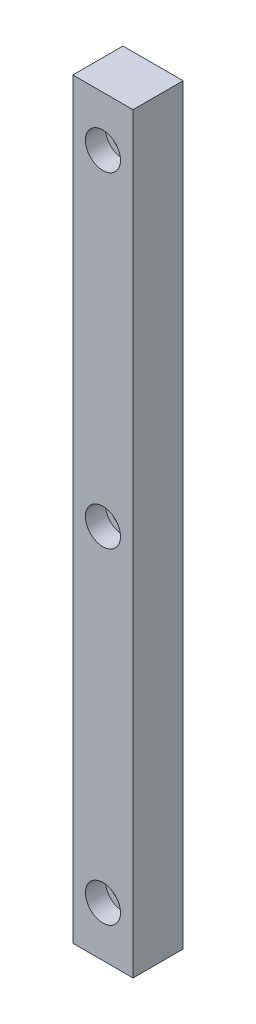
ISO-10303-21;
HEADER;
FILE_DESCRIPTION(('STEP AP214'),'2;1');
FILE_NAME('part.step','',(''),(''),'','','');
FILE_SCHEMA(('AUTOMOTIVE_DESIGN { 1 0 10303 214 1 1 1 1 }'));
ENDSEC;
DATA;
#1=APPLICATION_CONTEXT('core data for automotive mechanical design processes');
#2=APPLICATION_PROTOCOL_DEFINITION('international standard','automotive_design',2000,#1);
#3=PRODUCT_CONTEXT('',#1,'mechanical');
#4=PRODUCT('Part','Part','',(#3));
#5=PRODUCT_RELATED_PRODUCT_CATEGORY('part','',(#4));
#6=PRODUCT_DEFINITION_FORMATION('','',#4);
#7=PRODUCT_DEFINITION_CONTEXT('part definition',#1,'design');
#8=PRODUCT_DEFINITION('design','',#6,#7);
#9=PRODUCT_DEFINITION_SHAPE('','',#8);
#10=(LENGTH_UNIT() NAMED_UNIT(*) SI_UNIT(.MILLI.,.METRE.));
#11=(NAMED_UNIT(*) PLANE_ANGLE_UNIT() SI_UNIT($,.RADIAN.));
#12=(NAMED_UNIT(*) SI_UNIT($,.STERADIAN.) SOLID_ANGLE_UNIT());
#13=UNCERTAINTY_MEASURE_WITH_UNIT(LENGTH_MEASURE(1.E-05),#10,'distance_accuracy_value','');
#14=(GEOMETRIC_REPRESENTATION_CONTEXT(3) GLOBAL_UNCERTAINTY_ASSIGNED_CONTEXT((#13)) GLOBAL_UNIT_ASSIGNED_CONTEXT((#10,
#11,#12)) REPRESENTATION_CONTEXT('',''));
#15=CARTESIAN_POINT('',(0.,0.,0.));
#16=DIRECTION('',(0.,0.,1.));
#17=DIRECTION('',(1.,0.,0.));
#18=AXIS2_PLACEMENT_3D('',#15,#16,#17);
#19=CARTESIAN_POINT('',(0.,-65.,10.));
#20=DIRECTION('',(0.,0.,-1.));
#21=DIRECTION('',(-1.,0.,0.));
#22=AXIS2_PLACEMENT_3D('',#19,#20,#21);
#23=CYLINDRICAL_SURFACE('',#22,2.25);
#24=CARTESIAN_POINT('',(0.,-65.,0.));
#25=DIRECTION('',(0.,0.,1.));
#26=DIRECTION('',(1.,0.,0.));
#27=AXIS2_PLACEMENT_3D('',#24,#25,#26);
#28=CIRCLE('',#27,2.25);
#29=CARTESIAN_POINT('',(2.25,-65.,0.));
#30=VERTEX_POINT('',#29);
#31=EDGE_CURVE('E112',#30,#30,#28,.T.);
#32=ORIENTED_EDGE('',*,*,#31,.F.);
#33=EDGE_LOOP('',(#32));
#34=FACE_BOUND('',#33,.T.);
#35=CARTESIAN_POINT('',(0.,-65.,6.));
#36=DIRECTION('',(0.,0.,1.));
#37=DIRECTION('',(1.,0.,0.));
#38=AXIS2_PLACEMENT_3D('',#35,#36,#37);
#39=CIRCLE('',#38,2.25);
#40=CARTESIAN_POINT('',(2.25,-65.,6.));
#41=VERTEX_POINT('',#40);
#42=EDGE_CURVE('E38',#41,#41,#39,.T.);
#43=ORIENTED_EDGE('',*,*,#42,.T.);
#44=EDGE_LOOP('',(#43));
#45=FACE_BOUND('',#44,.T.);
#46=ADVANCED_FACE('F34',(#34,#45),#23,.F.);
#47=CARTESIAN_POINT('',(0.,0.,10.));
#48=DIRECTION('',(0.,0.,-1.));
#49=DIRECTION('',(-1.,0.,0.));
#50=AXIS2_PLACEMENT_3D('',#47,#48,#49);
#51=CYLINDRICAL_SURFACE('',#50,2.25);
#52=CARTESIAN_POINT('',(0.,0.,0.));
#53=DIRECTION('',(0.,0.,1.));
#54=DIRECTION('',(1.,0.,0.));
#55=AXIS2_PLACEMENT_3D('',#52,#53,#54);
#56=CIRCLE('',#55,2.25);
#57=CARTESIAN_POINT('',(2.25,0.,0.));
#58=VERTEX_POINT('',#57);
#59=EDGE_CURVE('E137',#58,#58,#56,.T.);
#60=ORIENTED_EDGE('',*,*,#59,.F.);
#61=EDGE_LOOP('',(#60));
#62=FACE_BOUND('',#61,.T.);
#63=CARTESIAN_POINT('',(0.,0.,6.));
#64=DIRECTION('',(0.,0.,1.));
#65=DIRECTION('',(1.,0.,0.));
#66=AXIS2_PLACEMENT_3D('',#63,#64,#65);
#67=CIRCLE('',#66,2.25);
#68=CARTESIAN_POINT('',(2.25,0.,6.));
#69=VERTEX_POINT('',#68);
#70=EDGE_CURVE('E114',#69,#69,#67,.T.);
#71=ORIENTED_EDGE('',*,*,#70,.T.);
#72=EDGE_LOOP('',(#71));
#73=FACE_BOUND('',#72,.T.);
#74=ADVANCED_FACE('F149',(#62,#73),#51,.F.);
#75=CARTESIAN_POINT('',(0.,65.,10.));
#76=DIRECTION('',(0.,0.,-1.));
#77=DIRECTION('',(-1.,0.,0.));
#78=AXIS2_PLACEMENT_3D('',#75,#76,#77);
#79=CYLINDRICAL_SURFACE('',#78,2.25);
#80=CARTESIAN_POINT('',(0.,65.,0.));
#81=DIRECTION('',(0.,0.,1.));
#82=DIRECTION('',(1.,0.,0.));
#83=AXIS2_PLACEMENT_3D('',#80,#81,#82);
#84=CIRCLE('',#83,2.25);
#85=CARTESIAN_POINT('',(2.25,65.,0.));
#86=VERTEX_POINT('',#85);
#87=EDGE_CURVE('E104',#86,#86,#84,.T.);
#88=ORIENTED_EDGE('',*,*,#87,.F.);
#89=EDGE_LOOP('',(#88));
#90=FACE_BOUND('',#89,.T.);
#91=CARTESIAN_POINT('',(0.,65.,6.));
#92=DIRECTION('',(0.,0.,1.));
#93=DIRECTION('',(1.,0.,0.));
#94=AXIS2_PLACEMENT_3D('',#91,#92,#93);
#95=CIRCLE('',#94,2.25);
#96=CARTESIAN_POINT('',(2.25,65.,6.));
#97=VERTEX_POINT('',#96);
#98=EDGE_CURVE('E110',#97,#97,#95,.T.);
#99=ORIENTED_EDGE('',*,*,#98,.T.);
#100=EDGE_LOOP('',(#99));
#101=FACE_BOUND('',#100,.T.);
#102=ADVANCED_FACE('F146',(#90,#101),#79,.F.);
#103=CARTESIAN_POINT('',(-6.,75.,10.));
#104=DIRECTION('',(0.,0.,1.));
#105=DIRECTION('',(1.,0.,0.));
#106=AXIS2_PLACEMENT_3D('',#103,#104,#105);
#107=PLANE('',#106);
#108=CARTESIAN_POINT('',(0.,-65.,10.));
#109=DIRECTION('',(0.,0.,1.));
#110=DIRECTION('',(1.,0.,0.));
#111=AXIS2_PLACEMENT_3D('',#108,#109,#110);
#112=CIRCLE('',#111,3.5);
#113=CARTESIAN_POINT('',(3.5,-65.,10.));
#114=VERTEX_POINT('',#113);
#115=EDGE_CURVE('E130',#114,#114,#112,.T.);
#116=ORIENTED_EDGE('',*,*,#115,.F.);
#117=EDGE_LOOP('',(#116));
#118=FACE_BOUND('',#117,.T.);
#119=CARTESIAN_POINT('',(0.,0.,10.));
#120=DIRECTION('',(0.,0.,1.));
#121=DIRECTION('',(1.,0.,0.));
#122=AXIS2_PLACEMENT_3D('',#119,#120,#121);
#123=CIRCLE('',#122,3.5);
#124=CARTESIAN_POINT('',(3.5,0.,10.));
#125=VERTEX_POINT('',#124);
#126=EDGE_CURVE('E123',#125,#125,#123,.T.);
#127=ORIENTED_EDGE('',*,*,#126,.F.);
#128=EDGE_LOOP('',(#127));
#129=FACE_BOUND('',#128,.T.);
#130=CARTESIAN_POINT('',(0.,65.,10.));
#131=DIRECTION('',(0.,0.,1.));
#132=DIRECTION('',(1.,0.,0.));
#133=AXIS2_PLACEMENT_3D('',#130,#131,#132);
#134=CIRCLE('',#133,3.5);
#135=CARTESIAN_POINT('',(3.5,65.,10.));
#136=VERTEX_POINT('',#135);
#137=EDGE_CURVE('E116',#136,#136,#134,.T.);
#138=ORIENTED_EDGE('',*,*,#137,.F.);
#139=EDGE_LOOP('',(#138));
#140=FACE_BOUND('',#139,.T.);
#141=DIRECTION('',(0.,-1.,0.));
#142=VECTOR('',#141,1.);
#143=CARTESIAN_POINT('',(-6.,-75.,10.));
#144=LINE('',#143,#142);
#145=CARTESIAN_POINT('',(-6.,75.,10.));
#146=VERTEX_POINT('',#145);
#147=CARTESIAN_POINT('',(-6.,-75.,10.));
#148=VERTEX_POINT('',#147);
#149=EDGE_CURVE('E88',#146,#148,#144,.T.);
#150=ORIENTED_EDGE('',*,*,#149,.T.);
#151=DIRECTION('',(1.,0.,0.));
#152=VECTOR('',#151,1.);
#153=CARTESIAN_POINT('',(6.,-75.,10.));
#154=LINE('',#153,#152);
#155=CARTESIAN_POINT('',(6.,-75.,10.));
#156=VERTEX_POINT('',#155);
#157=EDGE_CURVE('E83',#148,#156,#154,.T.);
#158=ORIENTED_EDGE('',*,*,#157,.T.);
#159=DIRECTION('',(0.,1.,0.));
#160=VECTOR('',#159,1.);
#161=CARTESIAN_POINT('',(6.,-75.,10.));
#162=LINE('',#161,#160);
#163=CARTESIAN_POINT('',(6.,75.,10.));
#164=VERTEX_POINT('',#163);
#165=EDGE_CURVE('E86',#156,#164,#162,.T.);
#166=ORIENTED_EDGE('',*,*,#165,.T.);
#167=DIRECTION('',(-1.,0.,0.));
#168=VECTOR('',#167,1.);
#169=CARTESIAN_POINT('',(6.,75.,10.));
#170=LINE('',#169,#168);
#171=EDGE_CURVE('E53',#164,#146,#170,.T.);
#172=ORIENTED_EDGE('',*,*,#171,.T.);
#173=EDGE_LOOP('',(#150,#158,#166,#172));
#174=FACE_BOUND('',#173,.T.);
#175=ADVANCED_FACE('F84',(#118,#129,#140,#174),#107,.T.);
#176=CARTESIAN_POINT('',(-6.,75.,0.));
#177=DIRECTION('',(0.,0.,1.));
#178=DIRECTION('',(1.,0.,0.));
#179=AXIS2_PLACEMENT_3D('',#176,#177,#178);
#180=PLANE('',#179);
#181=ORIENTED_EDGE('',*,*,#59,.T.);
#182=EDGE_LOOP('',(#181));
#183=FACE_BOUND('',#182,.T.);
#184=DIRECTION('',(0.,-1.,0.));
#185=VECTOR('',#184,1.);
#186=CARTESIAN_POINT('',(-6.,-75.,0.));
#187=LINE('',#186,#185);
#188=CARTESIAN_POINT('',(-6.,75.,0.));
#189=VERTEX_POINT('',#188);
#190=CARTESIAN_POINT('',(-6.,-75.,0.));
#191=VERTEX_POINT('',#190);
#192=EDGE_CURVE('E101',#189,#191,#187,.T.);
#193=ORIENTED_EDGE('',*,*,#192,.F.);
#194=DIRECTION('',(-1.,0.,0.));
#195=VECTOR('',#194,1.);
#196=CARTESIAN_POINT('',(6.,75.,0.));
#197=LINE('',#196,#195);
#198=CARTESIAN_POINT('',(6.,75.,0.));
#199=VERTEX_POINT('',#198);
#200=EDGE_CURVE('E76',#199,#189,#197,.T.);
#201=ORIENTED_EDGE('',*,*,#200,.F.);
#202=DIRECTION('',(0.,1.,0.));
#203=VECTOR('',#202,1.);
#204=CARTESIAN_POINT('',(6.,-75.,0.));
#205=LINE('',#204,#203);
#206=CARTESIAN_POINT('',(6.,-75.,0.));
#207=VERTEX_POINT('',#206);
#208=EDGE_CURVE('E70',#207,#199,#205,.T.);
#209=ORIENTED_EDGE('',*,*,#208,.F.);
#210=DIRECTION('',(1.,0.,0.));
#211=VECTOR('',#210,1.);
#212=CARTESIAN_POINT('',(6.,-75.,0.));
#213=LINE('',#212,#211);
#214=EDGE_CURVE('E92',#191,#207,#213,.T.);
#215=ORIENTED_EDGE('',*,*,#214,.F.);
#216=EDGE_LOOP('',(#193,#201,#209,#215));
#217=FACE_BOUND('',#216,.T.);
#218=ORIENTED_EDGE('',*,*,#87,.T.);
#219=EDGE_LOOP('',(#218));
#220=FACE_BOUND('',#219,.T.);
#221=ORIENTED_EDGE('',*,*,#31,.T.);
#222=EDGE_LOOP('',(#221));
#223=FACE_BOUND('',#222,.T.);
#224=ADVANCED_FACE('F143',(#183,#217,#220,#223),#180,.F.);
#225=CARTESIAN_POINT('',(-6.,-75.,10.));
#226=DIRECTION('',(1.,0.,0.));
#227=DIRECTION('',(0.,0.,-1.));
#228=AXIS2_PLACEMENT_3D('',#225,#226,#227);
#229=PLANE('',#228);
#230=ORIENTED_EDGE('',*,*,#192,.T.);
#231=DIRECTION('',(0.,0.,-1.));
#232=VECTOR('',#231,1.);
#233=CARTESIAN_POINT('',(-6.,-75.,10.));
#234=LINE('',#233,#232);
#235=EDGE_CURVE('E11',#148,#191,#234,.T.);
#236=ORIENTED_EDGE('',*,*,#235,.F.);
#237=ORIENTED_EDGE('',*,*,#149,.F.);
#238=DIRECTION('',(0.,0.,-1.));
#239=VECTOR('',#238,1.);
#240=CARTESIAN_POINT('',(-6.,75.,10.));
#241=LINE('',#240,#239);
#242=EDGE_CURVE('E97',#146,#189,#241,.T.);
#243=ORIENTED_EDGE('',*,*,#242,.T.);
#244=EDGE_LOOP('',(#230,#236,#237,#243));
#245=FACE_BOUND('',#244,.T.);
#246=ADVANCED_FACE('F36',(#245),#229,.F.);
#247=CARTESIAN_POINT('',(6.,-75.,10.));
#248=DIRECTION('',(0.,1.,0.));
#249=DIRECTION('',(0.,0.,1.));
#250=AXIS2_PLACEMENT_3D('',#247,#248,#249);
#251=PLANE('',#250);
#252=ORIENTED_EDGE('',*,*,#214,.T.);
#253=DIRECTION('',(0.,0.,-1.));
#254=VECTOR('',#253,1.);
#255=CARTESIAN_POINT('',(6.,-75.,10.));
#256=LINE('',#255,#254);
#257=EDGE_CURVE('E44',#156,#207,#256,.T.);
#258=ORIENTED_EDGE('',*,*,#257,.F.);
#259=ORIENTED_EDGE('',*,*,#157,.F.);
#260=ORIENTED_EDGE('',*,*,#235,.T.);
#261=EDGE_LOOP('',(#252,#258,#259,#260));
#262=FACE_BOUND('',#261,.T.);
#263=ADVANCED_FACE('F91',(#262),#251,.F.);
#264=CARTESIAN_POINT('',(6.,-75.,10.));
#265=DIRECTION('',(-1.,0.,0.));
#266=DIRECTION('',(0.,0.,1.));
#267=AXIS2_PLACEMENT_3D('',#264,#265,#266);
#268=PLANE('',#267);
#269=ORIENTED_EDGE('',*,*,#208,.T.);
#270=DIRECTION('',(0.,0.,-1.));
#271=VECTOR('',#270,1.);
#272=CARTESIAN_POINT('',(6.,75.,10.));
#273=LINE('',#272,#271);
#274=EDGE_CURVE('E93',#164,#199,#273,.T.);
#275=ORIENTED_EDGE('',*,*,#274,.F.);
#276=ORIENTED_EDGE('',*,*,#165,.F.);
#277=ORIENTED_EDGE('',*,*,#257,.T.);
#278=EDGE_LOOP('',(#269,#275,#276,#277));
#279=FACE_BOUND('',#278,.T.);
#280=ADVANCED_FACE('F95',(#279),#268,.F.);
#281=CARTESIAN_POINT('',(6.,75.,10.));
#282=DIRECTION('',(0.,-1.,0.));
#283=DIRECTION('',(0.,0.,-1.));
#284=AXIS2_PLACEMENT_3D('',#281,#282,#283);
#285=PLANE('',#284);
#286=ORIENTED_EDGE('',*,*,#200,.T.);
#287=ORIENTED_EDGE('',*,*,#242,.F.);
#288=ORIENTED_EDGE('',*,*,#171,.F.);
#289=ORIENTED_EDGE('',*,*,#274,.T.);
#290=EDGE_LOOP('',(#286,#287,#288,#289));
#291=FACE_BOUND('',#290,.T.);
#292=ADVANCED_FACE('F163',(#291),#285,.F.);
#293=CARTESIAN_POINT('',(0.,65.,6.));
#294=DIRECTION('',(0.,0.,1.));
#295=DIRECTION('',(1.,0.,0.));
#296=AXIS2_PLACEMENT_3D('',#293,#294,#295);
#297=CYLINDRICAL_SURFACE('',#296,3.5);
#298=CARTESIAN_POINT('',(0.,65.,6.));
#299=DIRECTION('',(0.,0.,1.));
#300=DIRECTION('',(1.,0.,0.));
#301=AXIS2_PLACEMENT_3D('',#298,#299,#300);
#302=CIRCLE('',#301,3.5);
#303=CARTESIAN_POINT('',(3.5,65.,6.));
#304=VERTEX_POINT('',#303);
#305=EDGE_CURVE('E113',#304,#304,#302,.T.);
#306=ORIENTED_EDGE('',*,*,#305,.F.);
#307=EDGE_LOOP('',(#306));
#308=FACE_BOUND('',#307,.T.);
#309=ORIENTED_EDGE('',*,*,#137,.T.);
#310=EDGE_LOOP('',(#309));
#311=FACE_BOUND('',#310,.T.);
#312=ADVANCED_FACE('F157',(#308,#311),#297,.F.);
#313=CARTESIAN_POINT('',(0.,65.,6.));
#314=DIRECTION('',(0.,0.,1.));
#315=DIRECTION('',(1.,0.,0.));
#316=AXIS2_PLACEMENT_3D('',#313,#314,#315);
#317=PLANE('',#316);
#318=ORIENTED_EDGE('',*,*,#98,.F.);
#319=EDGE_LOOP('',(#318));
#320=FACE_BOUND('',#319,.T.);
#321=ORIENTED_EDGE('',*,*,#305,.T.);
#322=EDGE_LOOP('',(#321));
#323=FACE_BOUND('',#322,.T.);
#324=ADVANCED_FACE('F153',(#320,#323),#317,.T.);
#325=CARTESIAN_POINT('',(0.,0.,6.));
#326=DIRECTION('',(0.,0.,1.));
#327=DIRECTION('',(1.,0.,0.));
#328=AXIS2_PLACEMENT_3D('',#325,#326,#327);
#329=CYLINDRICAL_SURFACE('',#328,3.5);
#330=CARTESIAN_POINT('',(0.,0.,6.));
#331=DIRECTION('',(0.,0.,1.));
#332=DIRECTION('',(1.,0.,0.));
#333=AXIS2_PLACEMENT_3D('',#330,#331,#332);
#334=CIRCLE('',#333,3.5);
#335=CARTESIAN_POINT('',(3.5,0.,6.));
#336=VERTEX_POINT('',#335);
#337=EDGE_CURVE('E117',#336,#336,#334,.T.);
#338=ORIENTED_EDGE('',*,*,#337,.F.);
#339=EDGE_LOOP('',(#338));
#340=FACE_BOUND('',#339,.T.);
#341=ORIENTED_EDGE('',*,*,#126,.T.);
#342=EDGE_LOOP('',(#341));
#343=FACE_BOUND('',#342,.T.);
#344=ADVANCED_FACE('F156',(#340,#343),#329,.F.);
#345=CARTESIAN_POINT('',(0.,0.,6.));
#346=DIRECTION('',(0.,0.,1.));
#347=DIRECTION('',(1.,0.,0.));
#348=AXIS2_PLACEMENT_3D('',#345,#346,#347);
#349=PLANE('',#348);
#350=ORIENTED_EDGE('',*,*,#70,.F.);
#351=EDGE_LOOP('',(#350));
#352=FACE_BOUND('',#351,.T.);
#353=ORIENTED_EDGE('',*,*,#337,.T.);
#354=EDGE_LOOP('',(#353));
#355=FACE_BOUND('',#354,.T.);
#356=ADVANCED_FACE('F190',(#352,#355),#349,.T.);
#357=CARTESIAN_POINT('',(0.,-65.,6.));
#358=DIRECTION('',(0.,0.,1.));
#359=DIRECTION('',(1.,0.,0.));
#360=AXIS2_PLACEMENT_3D('',#357,#358,#359);
#361=CYLINDRICAL_SURFACE('',#360,3.5);
#362=CARTESIAN_POINT('',(0.,-65.,6.));
#363=DIRECTION('',(0.,0.,1.));
#364=DIRECTION('',(1.,0.,0.));
#365=AXIS2_PLACEMENT_3D('',#362,#363,#364);
#366=CIRCLE('',#365,3.5);
#367=CARTESIAN_POINT('',(3.5,-65.,6.));
#368=VERTEX_POINT('',#367);
#369=EDGE_CURVE('E209',#368,#368,#366,.T.);
#370=ORIENTED_EDGE('',*,*,#369,.F.);
#371=EDGE_LOOP('',(#370));
#372=FACE_BOUND('',#371,.T.);
#373=ORIENTED_EDGE('',*,*,#115,.T.);
#374=EDGE_LOOP('',(#373));
#375=FACE_BOUND('',#374,.T.);
#376=ADVANCED_FACE('F194',(#372,#375),#361,.F.);
#377=CARTESIAN_POINT('',(0.,-65.,6.));
#378=DIRECTION('',(0.,0.,1.));
#379=DIRECTION('',(1.,0.,0.));
#380=AXIS2_PLACEMENT_3D('',#377,#378,#379);
#381=PLANE('',#380);
#382=ORIENTED_EDGE('',*,*,#42,.F.);
#383=EDGE_LOOP('',(#382));
#384=FACE_BOUND('',#383,.T.);
#385=ORIENTED_EDGE('',*,*,#369,.T.);
#386=EDGE_LOOP('',(#385));
#387=FACE_BOUND('',#386,.T.);
#388=ADVANCED_FACE('F198',(#384,#387),#381,.T.);
#389=CLOSED_SHELL('',(#46,#74,#102,#175,#224,#246,#263,#280,#292,#312,#324,#344,#356,#376,#388));
#390=MANIFOLD_SOLID_BREP('B2',#389);
#391=ADVANCED_BREP_SHAPE_REPRESENTATION('',(#18,#390),#14);
#392=SHAPE_DEFINITION_REPRESENTATION(#9,#391);
ENDSEC;
END-ISO-10303-21;
